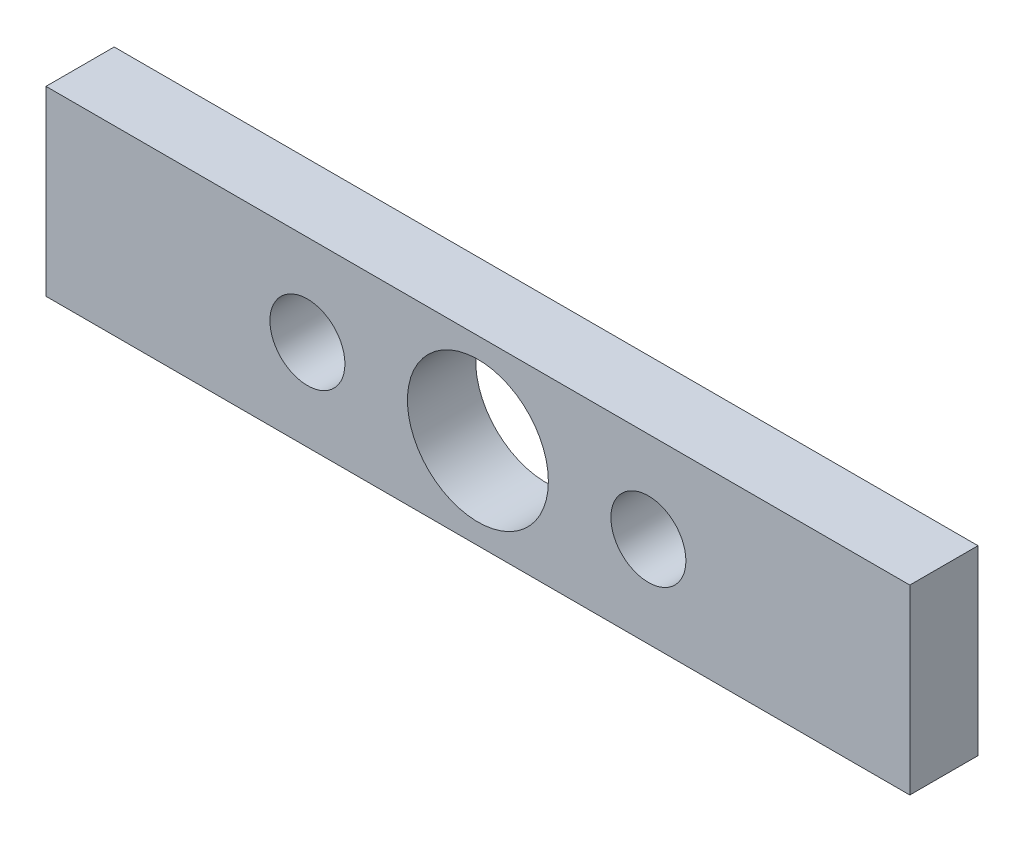
ISO-10303-21;
HEADER;
FILE_DESCRIPTION(('STEP AP214'),'2;1');
FILE_NAME('part.step','',(''),(''),'','','');
FILE_SCHEMA(('AUTOMOTIVE_DESIGN { 1 0 10303 214 1 1 1 1 }'));
ENDSEC;
DATA;
#1=APPLICATION_CONTEXT('core data for automotive mechanical design processes');
#2=APPLICATION_PROTOCOL_DEFINITION('international standard','automotive_design',2000,#1);
#3=PRODUCT_CONTEXT('',#1,'mechanical');
#4=PRODUCT('Part','Part','',(#3));
#5=PRODUCT_RELATED_PRODUCT_CATEGORY('part','',(#4));
#6=PRODUCT_DEFINITION_FORMATION('','',#4);
#7=PRODUCT_DEFINITION_CONTEXT('part definition',#1,'design');
#8=PRODUCT_DEFINITION('design','',#6,#7);
#9=PRODUCT_DEFINITION_SHAPE('','',#8);
#10=(LENGTH_UNIT() NAMED_UNIT(*) SI_UNIT(.MILLI.,.METRE.));
#11=(NAMED_UNIT(*) PLANE_ANGLE_UNIT() SI_UNIT($,.RADIAN.));
#12=(NAMED_UNIT(*) SI_UNIT($,.STERADIAN.) SOLID_ANGLE_UNIT());
#13=UNCERTAINTY_MEASURE_WITH_UNIT(LENGTH_MEASURE(1.E-05),#10,'distance_accuracy_value','');
#14=(GEOMETRIC_REPRESENTATION_CONTEXT(3) GLOBAL_UNCERTAINTY_ASSIGNED_CONTEXT((#13)) GLOBAL_UNIT_ASSIGNED_CONTEXT((#10,
#11,#12)) REPRESENTATION_CONTEXT('',''));
#15=CARTESIAN_POINT('',(0.,0.,0.));
#16=DIRECTION('',(0.,0.,1.));
#17=DIRECTION('',(1.,0.,0.));
#18=AXIS2_PLACEMENT_3D('',#15,#16,#17);
#19=CARTESIAN_POINT('',(-19.,0.,3.));
#20=DIRECTION('',(1.,0.,0.));
#21=DIRECTION('',(0.,0.,-1.));
#22=AXIS2_PLACEMENT_3D('',#19,#20,#21);
#23=PLANE('',#22);
#24=DIRECTION('',(0.,-1.,0.));
#25=VECTOR('',#24,1.);
#26=CARTESIAN_POINT('',(-19.,0.,0.));
#27=LINE('',#26,#25);
#28=CARTESIAN_POINT('',(-19.,8.,0.));
#29=VERTEX_POINT('',#28);
#30=CARTESIAN_POINT('',(-19.,0.,0.));
#31=VERTEX_POINT('',#30);
#32=EDGE_CURVE('E93',#29,#31,#27,.T.);
#33=ORIENTED_EDGE('',*,*,#32,.T.);
#34=DIRECTION('',(0.,0.,-1.));
#35=VECTOR('',#34,1.);
#36=CARTESIAN_POINT('',(-19.,0.,3.));
#37=LINE('',#36,#35);
#38=CARTESIAN_POINT('',(-19.,0.,3.));
#39=VERTEX_POINT('',#38);
#40=EDGE_CURVE('E11',#39,#31,#37,.T.);
#41=ORIENTED_EDGE('',*,*,#40,.F.);
#42=DIRECTION('',(0.,-1.,0.));
#43=VECTOR('',#42,1.);
#44=CARTESIAN_POINT('',(-19.,0.,3.));
#45=LINE('',#44,#43);
#46=CARTESIAN_POINT('',(-19.,8.,3.));
#47=VERTEX_POINT('',#46);
#48=EDGE_CURVE('E81',#47,#39,#45,.T.);
#49=ORIENTED_EDGE('',*,*,#48,.F.);
#50=DIRECTION('',(0.,0.,-1.));
#51=VECTOR('',#50,1.);
#52=CARTESIAN_POINT('',(-19.,8.,3.));
#53=LINE('',#52,#51);
#54=EDGE_CURVE('E89',#47,#29,#53,.T.);
#55=ORIENTED_EDGE('',*,*,#54,.T.);
#56=EDGE_LOOP('',(#33,#41,#49,#55));
#57=FACE_BOUND('',#56,.T.);
#58=ADVANCED_FACE('F30',(#57),#23,.F.);
#59=CARTESIAN_POINT('',(-19.,0.,3.));
#60=DIRECTION('',(0.,1.,0.));
#61=DIRECTION('',(0.,0.,1.));
#62=AXIS2_PLACEMENT_3D('',#59,#60,#61);
#63=PLANE('',#62);
#64=DIRECTION('',(1.,0.,0.));
#65=VECTOR('',#64,1.);
#66=CARTESIAN_POINT('',(-19.,0.,0.));
#67=LINE('',#66,#65);
#68=CARTESIAN_POINT('',(19.,0.,0.));
#69=VERTEX_POINT('',#68);
#70=EDGE_CURVE('E85',#31,#69,#67,.T.);
#71=ORIENTED_EDGE('',*,*,#70,.T.);
#72=DIRECTION('',(0.,0.,-1.));
#73=VECTOR('',#72,1.);
#74=CARTESIAN_POINT('',(19.,0.,3.));
#75=LINE('',#74,#73);
#76=CARTESIAN_POINT('',(19.,0.,3.));
#77=VERTEX_POINT('',#76);
#78=EDGE_CURVE('E38',#77,#69,#75,.T.);
#79=ORIENTED_EDGE('',*,*,#78,.F.);
#80=DIRECTION('',(1.,0.,0.));
#81=VECTOR('',#80,1.);
#82=CARTESIAN_POINT('',(-19.,0.,3.));
#83=LINE('',#82,#81);
#84=EDGE_CURVE('E76',#39,#77,#83,.T.);
#85=ORIENTED_EDGE('',*,*,#84,.F.);
#86=ORIENTED_EDGE('',*,*,#40,.T.);
#87=EDGE_LOOP('',(#71,#79,#85,#86));
#88=FACE_BOUND('',#87,.T.);
#89=ADVANCED_FACE('F84',(#88),#63,.F.);
#90=CARTESIAN_POINT('',(19.,0.,3.));
#91=DIRECTION('',(-1.,0.,0.));
#92=DIRECTION('',(0.,0.,1.));
#93=AXIS2_PLACEMENT_3D('',#90,#91,#92);
#94=PLANE('',#93);
#95=DIRECTION('',(0.,1.,0.));
#96=VECTOR('',#95,1.);
#97=CARTESIAN_POINT('',(19.,0.,0.));
#98=LINE('',#97,#96);
#99=CARTESIAN_POINT('',(19.,8.,0.));
#100=VERTEX_POINT('',#99);
#101=EDGE_CURVE('E63',#69,#100,#98,.T.);
#102=ORIENTED_EDGE('',*,*,#101,.T.);
#103=DIRECTION('',(0.,0.,-1.));
#104=VECTOR('',#103,1.);
#105=CARTESIAN_POINT('',(19.,8.,3.));
#106=LINE('',#105,#104);
#107=CARTESIAN_POINT('',(19.,8.,3.));
#108=VERTEX_POINT('',#107);
#109=EDGE_CURVE('E86',#108,#100,#106,.T.);
#110=ORIENTED_EDGE('',*,*,#109,.F.);
#111=DIRECTION('',(0.,1.,0.));
#112=VECTOR('',#111,1.);
#113=CARTESIAN_POINT('',(19.,0.,3.));
#114=LINE('',#113,#112);
#115=EDGE_CURVE('E79',#77,#108,#114,.T.);
#116=ORIENTED_EDGE('',*,*,#115,.F.);
#117=ORIENTED_EDGE('',*,*,#78,.T.);
#118=EDGE_LOOP('',(#102,#110,#116,#117));
#119=FACE_BOUND('',#118,.T.);
#120=ADVANCED_FACE('F87',(#119),#94,.F.);
#121=CARTESIAN_POINT('',(-19.,8.,3.));
#122=DIRECTION('',(0.,-1.,0.));
#123=DIRECTION('',(0.,0.,-1.));
#124=AXIS2_PLACEMENT_3D('',#121,#122,#123);
#125=PLANE('',#124);
#126=DIRECTION('',(-1.,0.,0.));
#127=VECTOR('',#126,1.);
#128=CARTESIAN_POINT('',(-19.,8.,0.));
#129=LINE('',#128,#127);
#130=EDGE_CURVE('E69',#100,#29,#129,.T.);
#131=ORIENTED_EDGE('',*,*,#130,.T.);
#132=ORIENTED_EDGE('',*,*,#54,.F.);
#133=DIRECTION('',(-1.,0.,0.));
#134=VECTOR('',#133,1.);
#135=CARTESIAN_POINT('',(-19.,8.,3.));
#136=LINE('',#135,#134);
#137=EDGE_CURVE('E46',#108,#47,#136,.T.);
#138=ORIENTED_EDGE('',*,*,#137,.F.);
#139=ORIENTED_EDGE('',*,*,#109,.T.);
#140=EDGE_LOOP('',(#131,#132,#138,#139));
#141=FACE_BOUND('',#140,.T.);
#142=ADVANCED_FACE('F101',(#141),#125,.F.);
#143=CARTESIAN_POINT('',(-19.,8.,3.));
#144=DIRECTION('',(0.,0.,-1.));
#145=DIRECTION('',(-1.,0.,0.));
#146=AXIS2_PLACEMENT_3D('',#143,#144,#145);
#147=PLANE('',#146);
#148=CARTESIAN_POINT('',(7.5,4.,3.));
#149=DIRECTION('',(0.,0.,1.));
#150=DIRECTION('',(1.,0.,0.));
#151=AXIS2_PLACEMENT_3D('',#148,#149,#150);
#152=CIRCLE('',#151,1.65);
#153=CARTESIAN_POINT('',(9.15,4.,3.));
#154=VERTEX_POINT('',#153);
#155=EDGE_CURVE('E119',#154,#154,#152,.T.);
#156=ORIENTED_EDGE('',*,*,#155,.F.);
#157=EDGE_LOOP('',(#156));
#158=FACE_BOUND('',#157,.T.);
#159=CARTESIAN_POINT('',(-7.5,4.,3.));
#160=DIRECTION('',(0.,0.,1.));
#161=DIRECTION('',(1.,0.,0.));
#162=AXIS2_PLACEMENT_3D('',#159,#160,#161);
#163=CIRCLE('',#162,1.65);
#164=CARTESIAN_POINT('',(-5.85,4.,3.));
#165=VERTEX_POINT('',#164);
#166=EDGE_CURVE('E113',#165,#165,#163,.T.);
#167=ORIENTED_EDGE('',*,*,#166,.F.);
#168=EDGE_LOOP('',(#167));
#169=FACE_BOUND('',#168,.T.);
#170=CARTESIAN_POINT('',(0.,4.,3.));
#171=DIRECTION('',(0.,0.,1.));
#172=DIRECTION('',(1.,0.,0.));
#173=AXIS2_PLACEMENT_3D('',#170,#171,#172);
#174=CIRCLE('',#173,3.1);
#175=CARTESIAN_POINT('',(3.1,4.,3.));
#176=VERTEX_POINT('',#175);
#177=EDGE_CURVE('E107',#176,#176,#174,.T.);
#178=ORIENTED_EDGE('',*,*,#177,.F.);
#179=EDGE_LOOP('',(#178));
#180=FACE_BOUND('',#179,.T.);
#181=ORIENTED_EDGE('',*,*,#48,.T.);
#182=ORIENTED_EDGE('',*,*,#84,.T.);
#183=ORIENTED_EDGE('',*,*,#115,.T.);
#184=ORIENTED_EDGE('',*,*,#137,.T.);
#185=EDGE_LOOP('',(#181,#182,#183,#184));
#186=FACE_BOUND('',#185,.T.);
#187=ADVANCED_FACE('F77',(#158,#169,#180,#186),#147,.F.);
#188=CARTESIAN_POINT('',(-19.,8.,0.));
#189=DIRECTION('',(0.,0.,-1.));
#190=DIRECTION('',(-1.,0.,0.));
#191=AXIS2_PLACEMENT_3D('',#188,#189,#190);
#192=PLANE('',#191);
#193=CARTESIAN_POINT('',(7.5,4.,0.));
#194=DIRECTION('',(0.,0.,1.));
#195=DIRECTION('',(1.,0.,0.));
#196=AXIS2_PLACEMENT_3D('',#193,#194,#195);
#197=CIRCLE('',#196,1.65);
#198=CARTESIAN_POINT('',(9.15,4.,0.));
#199=VERTEX_POINT('',#198);
#200=EDGE_CURVE('E116',#199,#199,#197,.T.);
#201=ORIENTED_EDGE('',*,*,#200,.T.);
#202=EDGE_LOOP('',(#201));
#203=FACE_BOUND('',#202,.T.);
#204=CARTESIAN_POINT('',(-7.5,4.,0.));
#205=DIRECTION('',(0.,0.,1.));
#206=DIRECTION('',(1.,0.,0.));
#207=AXIS2_PLACEMENT_3D('',#204,#205,#206);
#208=CIRCLE('',#207,1.65);
#209=CARTESIAN_POINT('',(-5.85,4.,0.));
#210=VERTEX_POINT('',#209);
#211=EDGE_CURVE('E110',#210,#210,#208,.T.);
#212=ORIENTED_EDGE('',*,*,#211,.T.);
#213=EDGE_LOOP('',(#212));
#214=FACE_BOUND('',#213,.T.);
#215=CARTESIAN_POINT('',(0.,4.,0.));
#216=DIRECTION('',(0.,0.,1.));
#217=DIRECTION('',(1.,0.,0.));
#218=AXIS2_PLACEMENT_3D('',#215,#216,#217);
#219=CIRCLE('',#218,3.1);
#220=CARTESIAN_POINT('',(3.1,4.,0.));
#221=VERTEX_POINT('',#220);
#222=EDGE_CURVE('E96',#221,#221,#219,.T.);
#223=ORIENTED_EDGE('',*,*,#222,.T.);
#224=EDGE_LOOP('',(#223));
#225=FACE_BOUND('',#224,.T.);
#226=ORIENTED_EDGE('',*,*,#32,.F.);
#227=ORIENTED_EDGE('',*,*,#130,.F.);
#228=ORIENTED_EDGE('',*,*,#101,.F.);
#229=ORIENTED_EDGE('',*,*,#70,.F.);
#230=EDGE_LOOP('',(#226,#227,#228,#229));
#231=FACE_BOUND('',#230,.T.);
#232=ADVANCED_FACE('F104',(#203,#214,#225,#231),#192,.T.);
#233=CARTESIAN_POINT('',(0.,4.,0.));
#234=DIRECTION('',(0.,0.,1.));
#235=DIRECTION('',(1.,0.,0.));
#236=AXIS2_PLACEMENT_3D('',#233,#234,#235);
#237=CYLINDRICAL_SURFACE('',#236,3.1);
#238=ORIENTED_EDGE('',*,*,#222,.F.);
#239=EDGE_LOOP('',(#238));
#240=FACE_BOUND('',#239,.T.);
#241=ORIENTED_EDGE('',*,*,#177,.T.);
#242=EDGE_LOOP('',(#241));
#243=FACE_BOUND('',#242,.T.);
#244=ADVANCED_FACE('F141',(#240,#243),#237,.F.);
#245=CARTESIAN_POINT('',(-7.5,4.,0.));
#246=DIRECTION('',(0.,0.,1.));
#247=DIRECTION('',(1.,0.,0.));
#248=AXIS2_PLACEMENT_3D('',#245,#246,#247);
#249=CYLINDRICAL_SURFACE('',#248,1.65);
#250=ORIENTED_EDGE('',*,*,#211,.F.);
#251=EDGE_LOOP('',(#250));
#252=FACE_BOUND('',#251,.T.);
#253=ORIENTED_EDGE('',*,*,#166,.T.);
#254=EDGE_LOOP('',(#253));
#255=FACE_BOUND('',#254,.T.);
#256=ADVANCED_FACE('F130',(#252,#255),#249,.F.);
#257=CARTESIAN_POINT('',(7.5,4.,0.));
#258=DIRECTION('',(0.,0.,1.));
#259=DIRECTION('',(1.,0.,0.));
#260=AXIS2_PLACEMENT_3D('',#257,#258,#259);
#261=CYLINDRICAL_SURFACE('',#260,1.65);
#262=ORIENTED_EDGE('',*,*,#200,.F.);
#263=EDGE_LOOP('',(#262));
#264=FACE_BOUND('',#263,.T.);
#265=ORIENTED_EDGE('',*,*,#155,.T.);
#266=EDGE_LOOP('',(#265));
#267=FACE_BOUND('',#266,.T.);
#268=ADVANCED_FACE('F127',(#264,#267),#261,.F.);
#269=CLOSED_SHELL('',(#58,#89,#120,#142,#187,#232,#244,#256,#268));
#270=MANIFOLD_SOLID_BREP('B2',#269);
#271=ADVANCED_BREP_SHAPE_REPRESENTATION('',(#18,#270),#14);
#272=SHAPE_DEFINITION_REPRESENTATION(#9,#271);
ENDSEC;
END-ISO-10303-21;
